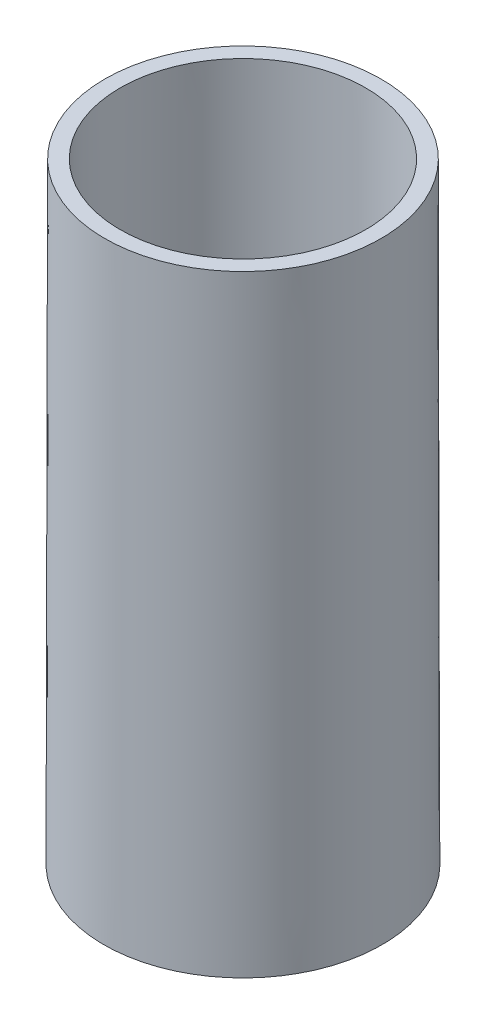
ISO-10303-21;
HEADER;
FILE_DESCRIPTION(('STEP AP214'),'2;1');
FILE_NAME('part.step','',(''),(''),'','','');
FILE_SCHEMA(('AUTOMOTIVE_DESIGN { 1 0 10303 214 1 1 1 1 }'));
ENDSEC;
DATA;
#1=APPLICATION_CONTEXT('core data for automotive mechanical design processes');
#2=APPLICATION_PROTOCOL_DEFINITION('international standard','automotive_design',2000,#1);
#3=PRODUCT_CONTEXT('',#1,'mechanical');
#4=PRODUCT('Part','Part','',(#3));
#5=PRODUCT_RELATED_PRODUCT_CATEGORY('part','',(#4));
#6=PRODUCT_DEFINITION_FORMATION('','',#4);
#7=PRODUCT_DEFINITION_CONTEXT('part definition',#1,'design');
#8=PRODUCT_DEFINITION('design','',#6,#7);
#9=PRODUCT_DEFINITION_SHAPE('','',#8);
#10=(LENGTH_UNIT() NAMED_UNIT(*) SI_UNIT(.MILLI.,.METRE.));
#11=(NAMED_UNIT(*) PLANE_ANGLE_UNIT() SI_UNIT($,.RADIAN.));
#12=(NAMED_UNIT(*) SI_UNIT($,.STERADIAN.) SOLID_ANGLE_UNIT());
#13=UNCERTAINTY_MEASURE_WITH_UNIT(LENGTH_MEASURE(1.E-05),#10,'distance_accuracy_value','');
#14=(GEOMETRIC_REPRESENTATION_CONTEXT(3) GLOBAL_UNCERTAINTY_ASSIGNED_CONTEXT((#13)) GLOBAL_UNIT_ASSIGNED_CONTEXT((#10,
#11,#12)) REPRESENTATION_CONTEXT('',''));
#15=CARTESIAN_POINT('',(0.,0.,0.));
#16=DIRECTION('',(0.,0.,1.));
#17=DIRECTION('',(1.,0.,0.));
#18=AXIS2_PLACEMENT_3D('',#15,#16,#17);
#19=CARTESIAN_POINT('',(0.,-318.391407512465,0.));
#20=DIRECTION('',(0.,-1.,0.));
#21=DIRECTION('',(1.,0.,0.));
#22=AXIS2_PLACEMENT_3D('',#19,#20,#21);
#23=CONICAL_SURFACE('',#22,50.,0.00177454351344344);
#24=CARTESIAN_POINT('',(0.,-318.391407512465,0.));
#25=DIRECTION('',(0.,1.,0.));
#26=DIRECTION('',(-1.,0.,0.));
#27=AXIS2_PLACEMENT_3D('',#24,#25,#26);
#28=CIRCLE('',#27,50.);
#29=CARTESIAN_POINT('',(-50.,-318.391407512465,0.));
#30=VERTEX_POINT('',#29);
#31=EDGE_CURVE('E10',#30,#30,#28,.T.);
#32=ORIENTED_EDGE('',*,*,#31,.T.);
#33=EDGE_LOOP('',(#32));
#34=FACE_BOUND('',#33,.T.);
#35=CARTESIAN_POINT('',(0.,-99.,0.));
#36=DIRECTION('',(0.,1.,0.));
#37=DIRECTION('',(-1.,0.,0.));
#38=AXIS2_PLACEMENT_3D('',#35,#36,#37);
#39=CIRCLE('',#38,49.6106799922366);
#40=CARTESIAN_POINT('',(-49.6106799922366,-99.,0.));
#41=VERTEX_POINT('',#40);
#42=EDGE_CURVE('E48',#41,#41,#39,.T.);
#43=ORIENTED_EDGE('',*,*,#42,.F.);
#44=EDGE_LOOP('',(#43));
#45=FACE_BOUND('',#44,.T.);
#46=ADVANCED_FACE('F37',(#34,#45),#23,.T.);
#47=CARTESIAN_POINT('',(0.,-6.08820448719212,0.));
#48=DIRECTION('',(0.,-1.,0.));
#49=DIRECTION('',(1.,0.,0.));
#50=AXIS2_PLACEMENT_3D('',#47,#48,#49);
#51=CONICAL_SURFACE('',#50,43.930100232201,0.00177454351344355);
#52=CARTESIAN_POINT('',(0.,-318.391407512465,0.));
#53=DIRECTION('',(0.,1.,0.));
#54=DIRECTION('',(-1.,0.,0.));
#55=AXIS2_PLACEMENT_3D('',#52,#53,#54);
#56=CIRCLE('',#55,44.4842964370794);
#57=CARTESIAN_POINT('',(-44.4842964370794,-318.391407512465,0.));
#58=VERTEX_POINT('',#57);
#59=EDGE_CURVE('E44',#58,#58,#56,.T.);
#60=ORIENTED_EDGE('',*,*,#59,.F.);
#61=EDGE_LOOP('',(#60));
#62=FACE_BOUND('',#61,.T.);
#63=CARTESIAN_POINT('',(0.,-99.,0.));
#64=DIRECTION('',(0.,1.,0.));
#65=DIRECTION('',(-1.,0.,0.));
#66=AXIS2_PLACEMENT_3D('',#63,#64,#65);
#67=CIRCLE('',#66,44.094976429316);
#68=CARTESIAN_POINT('',(-44.094976429316,-99.,0.));
#69=VERTEX_POINT('',#68);
#70=EDGE_CURVE('E40',#69,#69,#67,.F.);
#71=ORIENTED_EDGE('',*,*,#70,.F.);
#72=EDGE_LOOP('',(#71));
#73=FACE_BOUND('',#72,.T.);
#74=ADVANCED_FACE('F59',(#62,#73),#51,.F.);
#75=CARTESIAN_POINT('',(50.,-318.391407512465,0.));
#76=DIRECTION('',(0.,1.,0.));
#77=DIRECTION('',(-1.,0.,0.));
#78=AXIS2_PLACEMENT_3D('',#75,#76,#77);
#79=PLANE('',#78);
#80=ORIENTED_EDGE('',*,*,#31,.F.);
#81=EDGE_LOOP('',(#80));
#82=FACE_BOUND('',#81,.T.);
#83=ORIENTED_EDGE('',*,*,#59,.T.);
#84=EDGE_LOOP('',(#83));
#85=FACE_BOUND('',#84,.T.);
#86=ADVANCED_FACE('F61',(#82,#85),#79,.F.);
#87=CARTESIAN_POINT('',(0.,-99.,0.));
#88=DIRECTION('',(0.,1.,0.));
#89=DIRECTION('',(-1.,0.,0.));
#90=AXIS2_PLACEMENT_3D('',#87,#88,#89);
#91=PLANE('',#90);
#92=ORIENTED_EDGE('',*,*,#70,.T.);
#93=EDGE_LOOP('',(#92));
#94=FACE_BOUND('',#93,.T.);
#95=ORIENTED_EDGE('',*,*,#42,.T.);
#96=EDGE_LOOP('',(#95));
#97=FACE_BOUND('',#96,.T.);
#98=ADVANCED_FACE('F57',(#94,#97),#91,.T.);
#99=CLOSED_SHELL('',(#46,#74,#86,#98));
#100=MANIFOLD_SOLID_BREP('B2',#99);
#101=ADVANCED_BREP_SHAPE_REPRESENTATION('',(#18,#100),#14);
#102=SHAPE_DEFINITION_REPRESENTATION(#9,#101);
ENDSEC;
END-ISO-10303-21;
